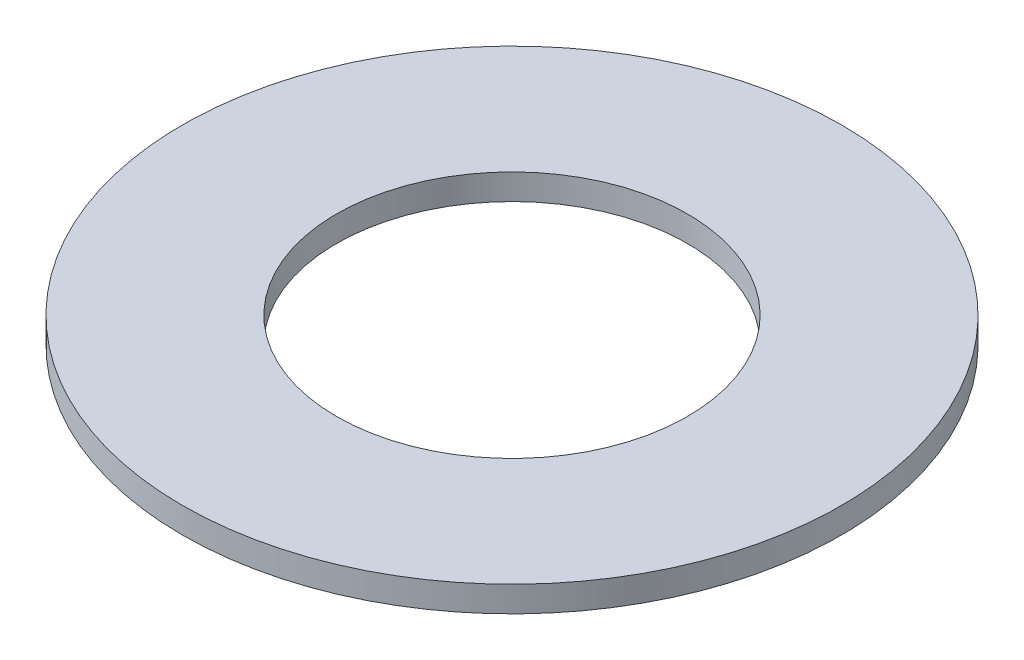
ISO-10303-21;
HEADER;
FILE_DESCRIPTION(('STEP AP214'),'2;1');
FILE_NAME('part.step','',(''),(''),'','','');
FILE_SCHEMA(('AUTOMOTIVE_DESIGN { 1 0 10303 214 1 1 1 1 }'));
ENDSEC;
DATA;
#1=APPLICATION_CONTEXT('core data for automotive mechanical design processes');
#2=APPLICATION_PROTOCOL_DEFINITION('international standard','automotive_design',2000,#1);
#3=PRODUCT_CONTEXT('',#1,'mechanical');
#4=PRODUCT('Part','Part','',(#3));
#5=PRODUCT_RELATED_PRODUCT_CATEGORY('part','',(#4));
#6=PRODUCT_DEFINITION_FORMATION('','',#4);
#7=PRODUCT_DEFINITION_CONTEXT('part definition',#1,'design');
#8=PRODUCT_DEFINITION('design','',#6,#7);
#9=PRODUCT_DEFINITION_SHAPE('','',#8);
#10=(LENGTH_UNIT() NAMED_UNIT(*) SI_UNIT(.MILLI.,.METRE.));
#11=(NAMED_UNIT(*) PLANE_ANGLE_UNIT() SI_UNIT($,.RADIAN.));
#12=(NAMED_UNIT(*) SI_UNIT($,.STERADIAN.) SOLID_ANGLE_UNIT());
#13=UNCERTAINTY_MEASURE_WITH_UNIT(LENGTH_MEASURE(1.E-05),#10,'distance_accuracy_value','');
#14=(GEOMETRIC_REPRESENTATION_CONTEXT(3) GLOBAL_UNCERTAINTY_ASSIGNED_CONTEXT((#13)) GLOBAL_UNIT_ASSIGNED_CONTEXT((#10,
#11,#12)) REPRESENTATION_CONTEXT('',''));
#15=CARTESIAN_POINT('',(0.,0.,0.));
#16=DIRECTION('',(0.,0.,1.));
#17=DIRECTION('',(1.,0.,0.));
#18=AXIS2_PLACEMENT_3D('',#15,#16,#17);
#19=CARTESIAN_POINT('',(0.,0.6,0.));
#20=DIRECTION('',(0.,1.,0.));
#21=DIRECTION('',(0.,0.,1.));
#22=AXIS2_PLACEMENT_3D('',#19,#20,#21);
#23=PLANE('',#22);
#24=CARTESIAN_POINT('',(0.,0.6,0.));
#25=DIRECTION('',(0.,1.,0.));
#26=DIRECTION('',(0.,0.,1.));
#27=AXIS2_PLACEMENT_3D('',#24,#25,#26);
#28=CIRCLE('',#27,7.7);
#29=CARTESIAN_POINT('',(0.,0.6,7.7));
#30=VERTEX_POINT('',#29);
#31=EDGE_CURVE('E10',#30,#30,#28,.T.);
#32=ORIENTED_EDGE('',*,*,#31,.T.);
#33=EDGE_LOOP('',(#32));
#34=FACE_BOUND('',#33,.T.);
#35=CARTESIAN_POINT('',(0.,0.6,0.));
#36=DIRECTION('',(0.,1.,0.));
#37=DIRECTION('',(0.,0.,1.));
#38=AXIS2_PLACEMENT_3D('',#35,#36,#37);
#39=CIRCLE('',#38,4.1);
#40=CARTESIAN_POINT('',(0.,0.6,4.1));
#41=VERTEX_POINT('',#40);
#42=EDGE_CURVE('E41',#41,#41,#39,.T.);
#43=ORIENTED_EDGE('',*,*,#42,.F.);
#44=EDGE_LOOP('',(#43));
#45=FACE_BOUND('',#44,.T.);
#46=ADVANCED_FACE('F30',(#34,#45),#23,.T.);
#47=CARTESIAN_POINT('',(0.,0.,0.));
#48=DIRECTION('',(0.,1.,0.));
#49=DIRECTION('',(0.,0.,1.));
#50=AXIS2_PLACEMENT_3D('',#47,#48,#49);
#51=PLANE('',#50);
#52=CARTESIAN_POINT('',(0.,0.,0.));
#53=DIRECTION('',(0.,1.,0.));
#54=DIRECTION('',(0.,0.,1.));
#55=AXIS2_PLACEMENT_3D('',#52,#53,#54);
#56=CIRCLE('',#55,7.7);
#57=CARTESIAN_POINT('',(0.,0.,7.7));
#58=VERTEX_POINT('',#57);
#59=EDGE_CURVE('E34',#58,#58,#56,.T.);
#60=ORIENTED_EDGE('',*,*,#59,.F.);
#61=EDGE_LOOP('',(#60));
#62=FACE_BOUND('',#61,.T.);
#63=CARTESIAN_POINT('',(0.,0.,0.));
#64=DIRECTION('',(0.,1.,0.));
#65=DIRECTION('',(0.,0.,1.));
#66=AXIS2_PLACEMENT_3D('',#63,#64,#65);
#67=CIRCLE('',#66,4.1);
#68=CARTESIAN_POINT('',(0.,0.,4.1));
#69=VERTEX_POINT('',#68);
#70=EDGE_CURVE('E43',#69,#69,#67,.T.);
#71=ORIENTED_EDGE('',*,*,#70,.T.);
#72=EDGE_LOOP('',(#71));
#73=FACE_BOUND('',#72,.T.);
#74=ADVANCED_FACE('F53',(#62,#73),#51,.F.);
#75=CARTESIAN_POINT('',(0.,0.6,0.));
#76=DIRECTION('',(0.,-1.,0.));
#77=DIRECTION('',(0.,0.,-1.));
#78=AXIS2_PLACEMENT_3D('',#75,#76,#77);
#79=CYLINDRICAL_SURFACE('',#78,7.7);
#80=ORIENTED_EDGE('',*,*,#31,.F.);
#81=EDGE_LOOP('',(#80));
#82=FACE_BOUND('',#81,.T.);
#83=ORIENTED_EDGE('',*,*,#59,.T.);
#84=EDGE_LOOP('',(#83));
#85=FACE_BOUND('',#84,.T.);
#86=ADVANCED_FACE('F32',(#82,#85),#79,.T.);
#87=CARTESIAN_POINT('',(0.,0.6,0.));
#88=DIRECTION('',(0.,-1.,0.));
#89=DIRECTION('',(0.,0.,-1.));
#90=AXIS2_PLACEMENT_3D('',#87,#88,#89);
#91=CYLINDRICAL_SURFACE('',#90,4.1);
#92=ORIENTED_EDGE('',*,*,#42,.T.);
#93=EDGE_LOOP('',(#92));
#94=FACE_BOUND('',#93,.T.);
#95=ORIENTED_EDGE('',*,*,#70,.F.);
#96=EDGE_LOOP('',(#95));
#97=FACE_BOUND('',#96,.T.);
#98=ADVANCED_FACE('F49',(#94,#97),#91,.F.);
#99=CLOSED_SHELL('',(#46,#74,#86,#98));
#100=MANIFOLD_SOLID_BREP('B2',#99);
#101=ADVANCED_BREP_SHAPE_REPRESENTATION('',(#18,#100),#14);
#102=SHAPE_DEFINITION_REPRESENTATION(#9,#101);
ENDSEC;
END-ISO-10303-21;
